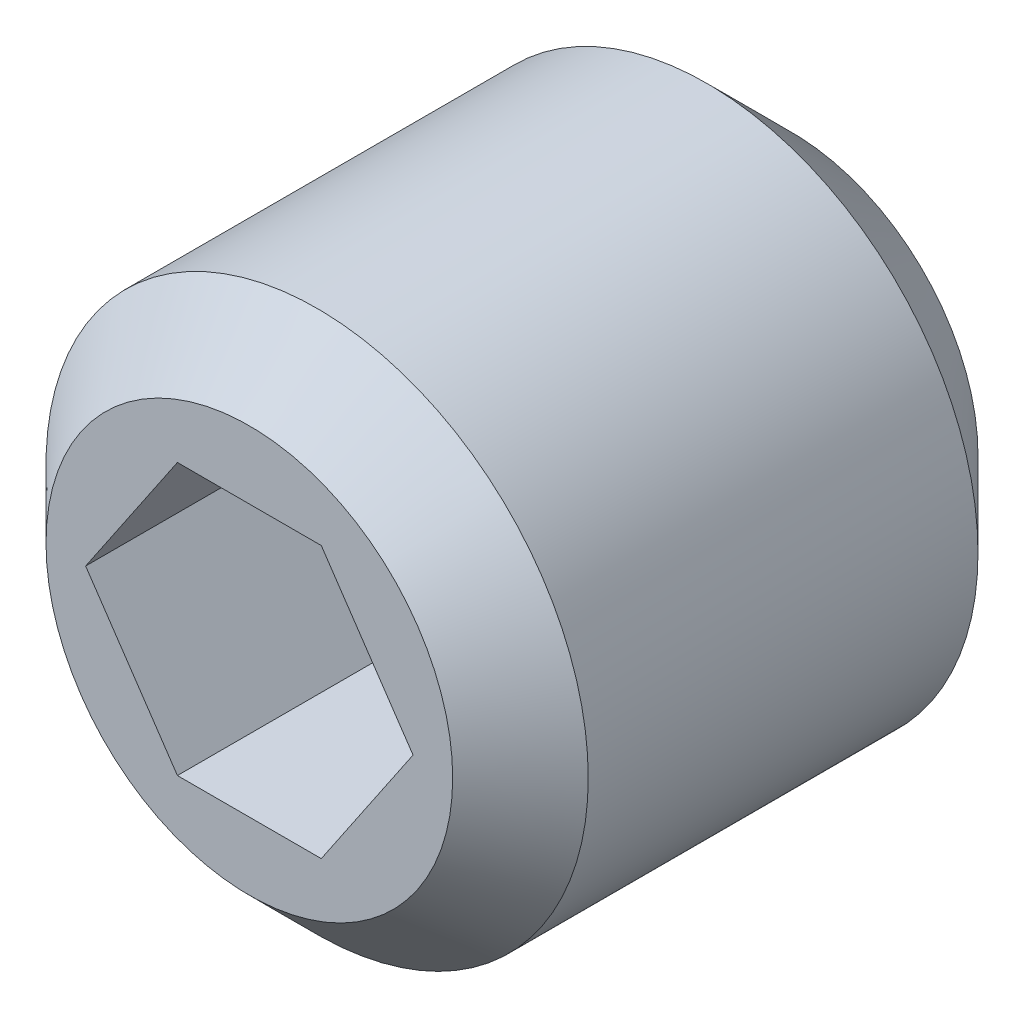
ISO-10303-21;
HEADER;
FILE_DESCRIPTION(('STEP AP214'),'2;1');
FILE_NAME('part.step','',(''),(''),'','','');
FILE_SCHEMA(('AUTOMOTIVE_DESIGN { 1 0 10303 214 1 1 1 1 }'));
ENDSEC;
DATA;
#1=APPLICATION_CONTEXT('core data for automotive mechanical design processes');
#2=APPLICATION_PROTOCOL_DEFINITION('international standard','automotive_design',2000,#1);
#3=PRODUCT_CONTEXT('',#1,'mechanical');
#4=PRODUCT('Part','Part','',(#3));
#5=PRODUCT_RELATED_PRODUCT_CATEGORY('part','',(#4));
#6=PRODUCT_DEFINITION_FORMATION('','',#4);
#7=PRODUCT_DEFINITION_CONTEXT('part definition',#1,'design');
#8=PRODUCT_DEFINITION('design','',#6,#7);
#9=PRODUCT_DEFINITION_SHAPE('','',#8);
#10=(LENGTH_UNIT() NAMED_UNIT(*) SI_UNIT(.MILLI.,.METRE.));
#11=(NAMED_UNIT(*) PLANE_ANGLE_UNIT() SI_UNIT($,.RADIAN.));
#12=(NAMED_UNIT(*) SI_UNIT($,.STERADIAN.) SOLID_ANGLE_UNIT());
#13=UNCERTAINTY_MEASURE_WITH_UNIT(LENGTH_MEASURE(1.E-05),#10,'distance_accuracy_value','');
#14=(GEOMETRIC_REPRESENTATION_CONTEXT(3) GLOBAL_UNCERTAINTY_ASSIGNED_CONTEXT((#13)) GLOBAL_UNIT_ASSIGNED_CONTEXT((#10,
#11,#12)) REPRESENTATION_CONTEXT('',''));
#15=CARTESIAN_POINT('',(0.,0.,0.));
#16=DIRECTION('',(0.,0.,1.));
#17=DIRECTION('',(1.,0.,0.));
#18=AXIS2_PLACEMENT_3D('',#15,#16,#17);
#19=CARTESIAN_POINT('',(0.,0.,8.00000000000007));
#20=DIRECTION('',(0.,0.,-1.));
#21=DIRECTION('',(-1.,0.,0.));
#22=AXIS2_PLACEMENT_3D('',#19,#20,#21);
#23=CYLINDRICAL_SURFACE('',#22,4.);
#24=CARTESIAN_POINT('',(0.,0.,7.00000000000012));
#25=DIRECTION('',(0.,0.,1.));
#26=DIRECTION('',(1.,0.,0.));
#27=AXIS2_PLACEMENT_3D('',#24,#25,#26);
#28=CIRCLE('',#27,4.);
#29=CARTESIAN_POINT('',(4.,0.,7.00000000000011));
#30=VERTEX_POINT('',#29);
#31=EDGE_CURVE('E11',#30,#30,#28,.F.);
#32=ORIENTED_EDGE('',*,*,#31,.T.);
#33=EDGE_LOOP('',(#32));
#34=FACE_BOUND('',#33,.T.);
#35=CARTESIAN_POINT('',(0.,0.,1.25000000000011));
#36=DIRECTION('',(0.,0.,1.));
#37=DIRECTION('',(1.,0.,0.));
#38=AXIS2_PLACEMENT_3D('',#35,#36,#37);
#39=CIRCLE('',#38,4.);
#40=CARTESIAN_POINT('',(4.,0.,1.25000000000011));
#41=VERTEX_POINT('',#40);
#42=EDGE_CURVE('E140',#41,#41,#39,.T.);
#43=ORIENTED_EDGE('',*,*,#42,.T.);
#44=EDGE_LOOP('',(#43));
#45=FACE_BOUND('',#44,.T.);
#46=ADVANCED_FACE('F33',(#34,#45),#23,.T.);
#47=CARTESIAN_POINT('',(0.,0.,8.00000000000007));
#48=DIRECTION('',(0.,0.,1.));
#49=DIRECTION('',(1.,0.,0.));
#50=AXIS2_PLACEMENT_3D('',#47,#48,#49);
#51=PLANE('',#50);
#52=CARTESIAN_POINT('',(0.,0.,8.00000000000007));
#53=DIRECTION('',(0.,0.,1.));
#54=DIRECTION('',(1.,0.,0.));
#55=AXIS2_PLACEMENT_3D('',#52,#53,#54);
#56=CIRCLE('',#55,2.99999999999998);
#57=CARTESIAN_POINT('',(2.99999999999997,0.,8.00000000000007));
#58=VERTEX_POINT('',#57);
#59=EDGE_CURVE('E40',#58,#58,#56,.T.);
#60=ORIENTED_EDGE('',*,*,#59,.T.);
#61=EDGE_LOOP('',(#60));
#62=FACE_BOUND('',#61,.T.);
#63=DIRECTION('',(0.560582505827001,0.828098577562311,0.));
#64=VECTOR('',#63,1.);
#65=CARTESIAN_POINT('',(1.06126856410381,-2.00000000000011,8.00000000000015));
#66=LINE('',#65,#64);
#67=CARTESIAN_POINT('',(1.06126856410381,-2.00000000000011,8.00000000000015));
#68=VERTEX_POINT('',#67);
#69=CARTESIAN_POINT('',(2.41517139890206,0.,8.00000000000013));
#70=VERTEX_POINT('',#69);
#71=EDGE_CURVE('E47',#68,#70,#66,.T.);
#72=ORIENTED_EDGE('',*,*,#71,.F.);
#73=DIRECTION('',(1.,0.,0.));
#74=VECTOR('',#73,1.);
#75=CARTESIAN_POINT('',(-1.06126856410403,-2.00000000000013,8.00000000000012));
#76=LINE('',#75,#74);
#77=CARTESIAN_POINT('',(-1.06126856410403,-2.00000000000013,8.00000000000012));
#78=VERTEX_POINT('',#77);
#79=EDGE_CURVE('E116',#78,#68,#76,.T.);
#80=ORIENTED_EDGE('',*,*,#79,.F.);
#81=DIRECTION('',(0.560582505826999,-0.82809857756231,0.));
#82=VECTOR('',#81,1.);
#83=CARTESIAN_POINT('',(-2.41517139890215,0.,8.00000000000001));
#84=LINE('',#83,#82);
#85=CARTESIAN_POINT('',(-2.41517139890215,0.,8.00000000000001));
#86=VERTEX_POINT('',#85);
#87=EDGE_CURVE('E110',#86,#78,#84,.T.);
#88=ORIENTED_EDGE('',*,*,#87,.F.);
#89=DIRECTION('',(-0.560582505827001,-0.828098577562311,0.));
#90=VECTOR('',#89,1.);
#91=CARTESIAN_POINT('',(-1.06126856410401,1.99999999999989,8.0000000000001));
#92=LINE('',#91,#90);
#93=CARTESIAN_POINT('',(-1.06126856410401,1.99999999999989,8.0000000000001));
#94=VERTEX_POINT('',#93);
#95=EDGE_CURVE('E108',#94,#86,#92,.T.);
#96=ORIENTED_EDGE('',*,*,#95,.F.);
#97=DIRECTION('',(-1.,0.,0.));
#98=VECTOR('',#97,1.);
#99=CARTESIAN_POINT('',(1.06126856410382,1.99999999999993,8.00000000000016));
#100=LINE('',#99,#98);
#101=CARTESIAN_POINT('',(1.06126856410382,1.99999999999993,8.00000000000016));
#102=VERTEX_POINT('',#101);
#103=EDGE_CURVE('E90',#102,#94,#100,.T.);
#104=ORIENTED_EDGE('',*,*,#103,.F.);
#105=DIRECTION('',(-0.560582505826999,0.82809857756231,0.));
#106=VECTOR('',#105,1.);
#107=CARTESIAN_POINT('',(2.41517139890206,0.,8.00000000000013));
#108=LINE('',#107,#106);
#109=EDGE_CURVE('E101',#70,#102,#108,.T.);
#110=ORIENTED_EDGE('',*,*,#109,.F.);
#111=EDGE_LOOP('',(#72,#80,#88,#96,#104,#110));
#112=FACE_BOUND('',#111,.T.);
#113=ADVANCED_FACE('F105',(#62,#112),#51,.T.);
#114=CARTESIAN_POINT('',(-1.21430643318376E-13,0.,1.2490009027033E-13));
#115=DIRECTION('',(0.,0.,1.));
#116=DIRECTION('',(1.,0.,0.));
#117=AXIS2_PLACEMENT_3D('',#114,#115,#116);
#118=PLANE('',#117);
#119=CARTESIAN_POINT('',(-1.21430643318376E-13,0.,1.2490009027033E-13));
#120=DIRECTION('',(0.,0.,1.));
#121=DIRECTION('',(1.,0.,0.));
#122=AXIS2_PLACEMENT_3D('',#119,#120,#121);
#123=CIRCLE('',#122,2.74999999999999);
#124=CARTESIAN_POINT('',(2.74999999999987,0.,1.21617993453782E-13));
#125=VERTEX_POINT('',#124);
#126=EDGE_CURVE('E143',#125,#125,#123,.F.);
#127=ORIENTED_EDGE('',*,*,#126,.T.);
#128=EDGE_LOOP('',(#127));
#129=FACE_BOUND('',#128,.T.);
#130=ADVANCED_FACE('F163',(#129),#118,.F.);
#131=CARTESIAN_POINT('',(0.,0.,1.25000000000011));
#132=DIRECTION('',(0.,0.,1.));
#133=DIRECTION('',(1.,0.,0.));
#134=AXIS2_PLACEMENT_3D('',#131,#132,#133);
#135=CONICAL_SURFACE('',#134,4.,0.785398163397443);
#136=ORIENTED_EDGE('',*,*,#126,.F.);
#137=EDGE_LOOP('',(#136));
#138=FACE_BOUND('',#137,.T.);
#139=ORIENTED_EDGE('',*,*,#42,.F.);
#140=EDGE_LOOP('',(#139));
#141=FACE_BOUND('',#140,.T.);
#142=ADVANCED_FACE('F168',(#138,#141),#135,.T.);
#143=CARTESIAN_POINT('',(1.06126856410385,-2.00000000000004,4.00000000000005));
#144=DIRECTION('',(0.828098577562312,-0.560582505827,0.));
#145=DIRECTION('',(0.560582505827001,0.828098577562311,0.));
#146=AXIS2_PLACEMENT_3D('',#143,#144,#145);
#147=PLANE('',#146);
#148=DIRECTION('',(0.,0.,1.));
#149=VECTOR('',#148,1.);
#150=CARTESIAN_POINT('',(1.06126856410385,-2.00000000000004,4.00000000000005));
#151=LINE('',#150,#149);
#152=CARTESIAN_POINT('',(1.06126856410385,-2.00000000000004,4.00000000000005));
#153=VERTEX_POINT('',#152);
#154=EDGE_CURVE('E54',#153,#68,#151,.T.);
#155=ORIENTED_EDGE('',*,*,#154,.T.);
#156=ORIENTED_EDGE('',*,*,#71,.T.);
#157=DIRECTION('',(0.,0.,1.));
#158=VECTOR('',#157,1.);
#159=CARTESIAN_POINT('',(2.41517139890206,0.,4.00000000000016));
#160=LINE('',#159,#158);
#161=CARTESIAN_POINT('',(2.41517139890206,0.,4.00000000000016));
#162=VERTEX_POINT('',#161);
#163=EDGE_CURVE('E98',#162,#70,#160,.T.);
#164=ORIENTED_EDGE('',*,*,#163,.F.);
#165=DIRECTION('',(0.560582505827001,0.828098577562311,0.));
#166=VECTOR('',#165,1.);
#167=CARTESIAN_POINT('',(1.06126856410385,-2.00000000000004,4.00000000000005));
#168=LINE('',#167,#166);
#169=EDGE_CURVE('E118',#153,#162,#168,.T.);
#170=ORIENTED_EDGE('',*,*,#169,.F.);
#171=EDGE_LOOP('',(#155,#156,#164,#170));
#172=FACE_BOUND('',#171,.T.);
#173=ADVANCED_FACE('F175',(#172),#147,.F.);
#174=CARTESIAN_POINT('',(-1.06126856410389,-2.00000000000004,4.00000000000011));
#175=DIRECTION('',(0.,-1.,0.));
#176=DIRECTION('',(0.,0.,-1.));
#177=AXIS2_PLACEMENT_3D('',#174,#175,#176);
#178=PLANE('',#177);
#179=DIRECTION('',(0.,0.,1.));
#180=VECTOR('',#179,1.);
#181=CARTESIAN_POINT('',(-1.06126856410389,-2.00000000000004,4.00000000000011));
#182=LINE('',#181,#180);
#183=CARTESIAN_POINT('',(-1.06126856410389,-2.00000000000004,4.00000000000011));
#184=VERTEX_POINT('',#183);
#185=EDGE_CURVE('E137',#184,#78,#182,.T.);
#186=ORIENTED_EDGE('',*,*,#185,.T.);
#187=ORIENTED_EDGE('',*,*,#79,.T.);
#188=ORIENTED_EDGE('',*,*,#154,.F.);
#189=DIRECTION('',(1.,0.,0.));
#190=VECTOR('',#189,1.);
#191=CARTESIAN_POINT('',(-1.06126856410389,-2.00000000000004,4.00000000000011));
#192=LINE('',#191,#190);
#193=EDGE_CURVE('E130',#184,#153,#192,.T.);
#194=ORIENTED_EDGE('',*,*,#193,.F.);
#195=EDGE_LOOP('',(#186,#187,#188,#194));
#196=FACE_BOUND('',#195,.T.);
#197=ADVANCED_FACE('F177',(#196),#178,.F.);
#198=CARTESIAN_POINT('',(-2.41517139890217,0.,4.00000000000014));
#199=DIRECTION('',(-0.828098577562312,-0.560582505827,0.));
#200=DIRECTION('',(0.560582505826999,-0.828098577562311,0.));
#201=AXIS2_PLACEMENT_3D('',#198,#199,#200);
#202=PLANE('',#201);
#203=DIRECTION('',(0.,0.,1.));
#204=VECTOR('',#203,1.);
#205=CARTESIAN_POINT('',(-2.41517139890217,0.,4.00000000000014));
#206=LINE('',#205,#204);
#207=CARTESIAN_POINT('',(-2.41517139890217,0.,4.00000000000014));
#208=VERTEX_POINT('',#207);
#209=EDGE_CURVE('E135',#208,#86,#206,.T.);
#210=ORIENTED_EDGE('',*,*,#209,.T.);
#211=ORIENTED_EDGE('',*,*,#87,.T.);
#212=ORIENTED_EDGE('',*,*,#185,.F.);
#213=DIRECTION('',(0.560582505826999,-0.82809857756231,0.));
#214=VECTOR('',#213,1.);
#215=CARTESIAN_POINT('',(-2.41517139890217,0.,4.00000000000014));
#216=LINE('',#215,#214);
#217=EDGE_CURVE('E127',#208,#184,#216,.T.);
#218=ORIENTED_EDGE('',*,*,#217,.F.);
#219=EDGE_LOOP('',(#210,#211,#212,#218));
#220=FACE_BOUND('',#219,.T.);
#221=ADVANCED_FACE('F180',(#220),#202,.F.);
#222=CARTESIAN_POINT('',(-1.0612685641039,1.99999999999999,4.00000000000015));
#223=DIRECTION('',(-0.828098577562312,0.560582505827,0.));
#224=DIRECTION('',(-0.560582505827001,-0.828098577562311,0.));
#225=AXIS2_PLACEMENT_3D('',#222,#223,#224);
#226=PLANE('',#225);
#227=DIRECTION('',(0.,0.,1.));
#228=VECTOR('',#227,1.);
#229=CARTESIAN_POINT('',(-1.0612685641039,1.99999999999999,4.00000000000015));
#230=LINE('',#229,#228);
#231=CARTESIAN_POINT('',(-1.0612685641039,1.99999999999999,4.00000000000015));
#232=VERTEX_POINT('',#231);
#233=EDGE_CURVE('E97',#232,#94,#230,.T.);
#234=ORIENTED_EDGE('',*,*,#233,.T.);
#235=ORIENTED_EDGE('',*,*,#95,.T.);
#236=ORIENTED_EDGE('',*,*,#209,.F.);
#237=DIRECTION('',(-0.560582505827001,-0.828098577562311,0.));
#238=VECTOR('',#237,1.);
#239=CARTESIAN_POINT('',(-1.0612685641039,1.99999999999999,4.00000000000015));
#240=LINE('',#239,#238);
#241=EDGE_CURVE('E124',#232,#208,#240,.T.);
#242=ORIENTED_EDGE('',*,*,#241,.F.);
#243=EDGE_LOOP('',(#234,#235,#236,#242));
#244=FACE_BOUND('',#243,.T.);
#245=ADVANCED_FACE('F183',(#244),#226,.F.);
#246=CARTESIAN_POINT('',(1.06126856410388,2.,4.));
#247=DIRECTION('',(0.,1.,0.));
#248=DIRECTION('',(0.,0.,1.));
#249=AXIS2_PLACEMENT_3D('',#246,#247,#248);
#250=PLANE('',#249);
#251=DIRECTION('',(0.,0.,1.));
#252=VECTOR('',#251,1.);
#253=CARTESIAN_POINT('',(1.06126856410388,2.,4.));
#254=LINE('',#253,#252);
#255=CARTESIAN_POINT('',(1.06126856410388,2.,4.));
#256=VERTEX_POINT('',#255);
#257=EDGE_CURVE('E86',#256,#102,#254,.T.);
#258=ORIENTED_EDGE('',*,*,#257,.T.);
#259=ORIENTED_EDGE('',*,*,#103,.T.);
#260=ORIENTED_EDGE('',*,*,#233,.F.);
#261=DIRECTION('',(-1.,0.,0.));
#262=VECTOR('',#261,1.);
#263=CARTESIAN_POINT('',(1.06126856410388,2.,4.));
#264=LINE('',#263,#262);
#265=EDGE_CURVE('E93',#256,#232,#264,.T.);
#266=ORIENTED_EDGE('',*,*,#265,.F.);
#267=EDGE_LOOP('',(#258,#259,#260,#266));
#268=FACE_BOUND('',#267,.T.);
#269=ADVANCED_FACE('F88',(#268),#250,.F.);
#270=CARTESIAN_POINT('',(2.41517139890206,0.,4.00000000000016));
#271=DIRECTION('',(0.828098577562312,0.560582505827,0.));
#272=DIRECTION('',(-0.560582505826999,0.828098577562311,0.));
#273=AXIS2_PLACEMENT_3D('',#270,#271,#272);
#274=PLANE('',#273);
#275=DIRECTION('',(-0.560582505826999,0.82809857756231,0.));
#276=VECTOR('',#275,1.);
#277=CARTESIAN_POINT('',(2.41517139890206,0.,4.00000000000016));
#278=LINE('',#277,#276);
#279=EDGE_CURVE('E121',#162,#256,#278,.T.);
#280=ORIENTED_EDGE('',*,*,#279,.F.);
#281=ORIENTED_EDGE('',*,*,#163,.T.);
#282=ORIENTED_EDGE('',*,*,#109,.T.);
#283=ORIENTED_EDGE('',*,*,#257,.F.);
#284=EDGE_LOOP('',(#280,#281,#282,#283));
#285=FACE_BOUND('',#284,.T.);
#286=ADVANCED_FACE('F102',(#285),#274,.F.);
#287=CARTESIAN_POINT('',(2.41517139890206,0.,4.00000000000016));
#288=DIRECTION('',(0.,0.,1.));
#289=DIRECTION('',(1.,0.,0.));
#290=AXIS2_PLACEMENT_3D('',#287,#288,#289);
#291=PLANE('',#290);
#292=ORIENTED_EDGE('',*,*,#169,.T.);
#293=ORIENTED_EDGE('',*,*,#279,.T.);
#294=ORIENTED_EDGE('',*,*,#265,.T.);
#295=ORIENTED_EDGE('',*,*,#241,.T.);
#296=ORIENTED_EDGE('',*,*,#217,.T.);
#297=ORIENTED_EDGE('',*,*,#193,.T.);
#298=EDGE_LOOP('',(#292,#293,#294,#295,#296,#297));
#299=FACE_BOUND('',#298,.T.);
#300=ADVANCED_FACE('F151',(#299),#291,.T.);
#301=CARTESIAN_POINT('',(0.,0.,8.00000000000007));
#302=DIRECTION('',(0.,0.,-1.));
#303=DIRECTION('',(-1.,0.,0.));
#304=AXIS2_PLACEMENT_3D('',#301,#302,#303);
#305=CONICAL_SURFACE('',#304,2.99999999999998,0.785398163397453);
#306=ORIENTED_EDGE('',*,*,#31,.F.);
#307=EDGE_LOOP('',(#306));
#308=FACE_BOUND('',#307,.T.);
#309=ORIENTED_EDGE('',*,*,#59,.F.);
#310=EDGE_LOOP('',(#309));
#311=FACE_BOUND('',#310,.T.);
#312=ADVANCED_FACE('F149',(#308,#311),#305,.T.);
#313=CLOSED_SHELL('',(#46,#113,#130,#142,#173,#197,#221,#245,#269,#286,#300,#312));
#314=MANIFOLD_SOLID_BREP('B2',#313);
#315=ADVANCED_BREP_SHAPE_REPRESENTATION('',(#18,#314),#14);
#316=SHAPE_DEFINITION_REPRESENTATION(#9,#315);
ENDSEC;
END-ISO-10303-21;
